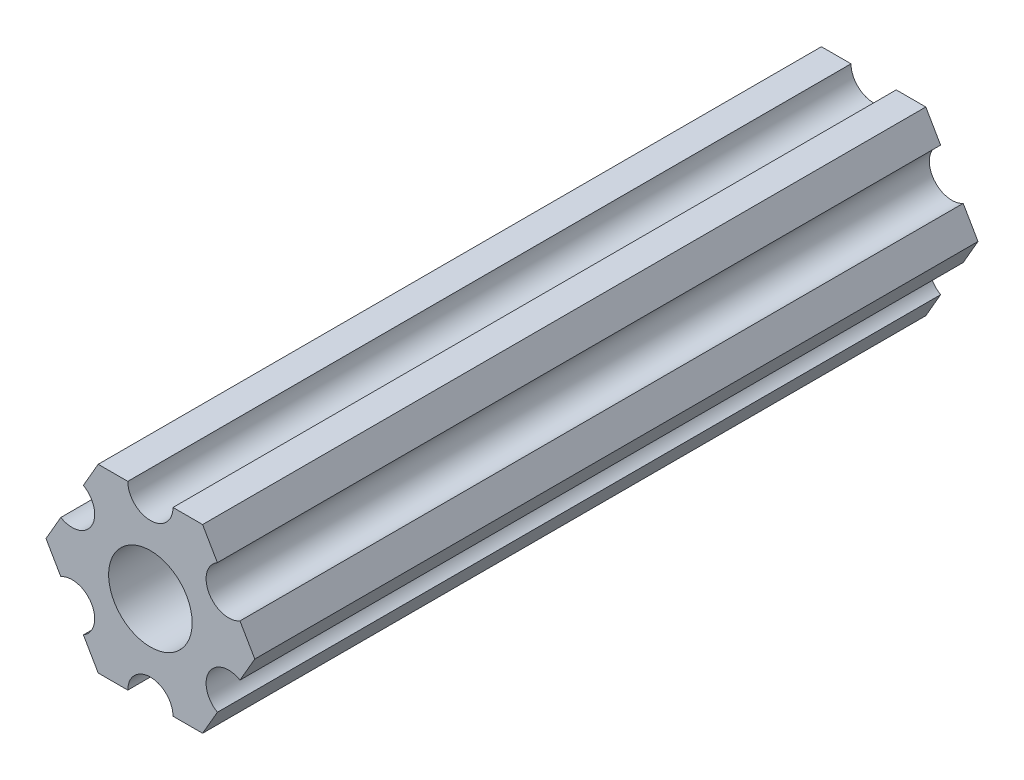
ISO-10303-21;
HEADER;
FILE_DESCRIPTION(('STEP AP214'),'2;1');
FILE_NAME('part.step','',(''),(''),'','','');
FILE_SCHEMA(('AUTOMOTIVE_DESIGN { 1 0 10303 214 1 1 1 1 }'));
ENDSEC;
DATA;
#1=APPLICATION_CONTEXT('core data for automotive mechanical design processes');
#2=APPLICATION_PROTOCOL_DEFINITION('international standard','automotive_design',2000,#1);
#3=PRODUCT_CONTEXT('',#1,'mechanical');
#4=PRODUCT('Part','Part','',(#3));
#5=PRODUCT_RELATED_PRODUCT_CATEGORY('part','',(#4));
#6=PRODUCT_DEFINITION_FORMATION('','',#4);
#7=PRODUCT_DEFINITION_CONTEXT('part definition',#1,'design');
#8=PRODUCT_DEFINITION('design','',#6,#7);
#9=PRODUCT_DEFINITION_SHAPE('','',#8);
#10=(LENGTH_UNIT() NAMED_UNIT(*) SI_UNIT(.MILLI.,.METRE.));
#11=(NAMED_UNIT(*) PLANE_ANGLE_UNIT() SI_UNIT($,.RADIAN.));
#12=(NAMED_UNIT(*) SI_UNIT($,.STERADIAN.) SOLID_ANGLE_UNIT());
#13=UNCERTAINTY_MEASURE_WITH_UNIT(LENGTH_MEASURE(1.E-05),#10,'distance_accuracy_value','');
#14=(GEOMETRIC_REPRESENTATION_CONTEXT(3) GLOBAL_UNCERTAINTY_ASSIGNED_CONTEXT((#13)) GLOBAL_UNIT_ASSIGNED_CONTEXT((#10,
#11,#12)) REPRESENTATION_CONTEXT('',''));
#15=CARTESIAN_POINT('',(0.,0.,0.));
#16=DIRECTION('',(0.,0.,1.));
#17=DIRECTION('',(1.,0.,0.));
#18=AXIS2_PLACEMENT_3D('',#15,#16,#17);
#19=CARTESIAN_POINT('',(5.49926150638083,-3.17499966684068,-50.8));
#20=DIRECTION('',(0.,0.,1.));
#21=DIRECTION('',(1.,0.,0.));
#22=AXIS2_PLACEMENT_3D('',#19,#20,#21);
#23=PLANE('',#22);
#24=CARTESIAN_POINT('',(5.49926150638083,-3.17499966684068,-50.8));
#25=DIRECTION('',(0.,0.,1.));
#26=DIRECTION('',(1.,0.,0.));
#27=AXIS2_PLACEMENT_3D('',#24,#25,#26);
#28=CIRCLE('',#27,1.58750000000001);
#29=CARTESIAN_POINT('',(6.29301142309098,-1.80018429024546,-50.8));
#30=VERTEX_POINT('',#29);
#31=CARTESIAN_POINT('',(4.70551158967068,-4.54981504343589,-50.8));
#32=VERTEX_POINT('',#31);
#33=EDGE_CURVE('E224',#30,#32,#28,.T.);
#34=ORIENTED_EDGE('',*,*,#33,.T.);
#35=DIRECTION('',(-0.499999947533953,-0.866025434075723,0.));
#36=VECTOR('',#35,1.);
#37=CARTESIAN_POINT('',(4.70551158967068,-4.54981504343589,-50.8));
#38=LINE('',#37,#36);
#39=CARTESIAN_POINT('',(3.66617452134693,-6.34999990382519,-50.8));
#40=VERTEX_POINT('',#39);
#41=EDGE_CURVE('E122',#32,#40,#38,.T.);
#42=ORIENTED_EDGE('',*,*,#41,.T.);
#43=DIRECTION('',(-1.,0.,0.));
#44=VECTOR('',#43,1.);
#45=CARTESIAN_POINT('',(3.66617452134693,-6.34999990382519,-50.8));
#46=LINE('',#45,#44);
#47=CARTESIAN_POINT('',(1.58750038469926,-6.34999990382518,-50.8));
#48=VERTEX_POINT('',#47);
#49=EDGE_CURVE('E269',#40,#48,#46,.T.);
#50=ORIENTED_EDGE('',*,*,#49,.T.);
#51=CARTESIAN_POINT('',(3.8469926204343E-07,-6.34999990382519,-50.8));
#52=DIRECTION('',(0.,0.,1.));
#53=DIRECTION('',(1.,0.,0.));
#54=AXIS2_PLACEMENT_3D('',#51,#52,#53);
#55=CIRCLE('',#54,1.5875);
#56=CARTESIAN_POINT('',(-1.58749961530074,-6.34999990382519,-50.8));
#57=VERTEX_POINT('',#56);
#58=EDGE_CURVE('E288',#48,#57,#55,.T.);
#59=ORIENTED_EDGE('',*,*,#58,.T.);
#60=DIRECTION('',(-1.,0.,0.));
#61=VECTOR('',#60,1.);
#62=CARTESIAN_POINT('',(-1.58749961530074,-6.34999990382519,-50.8));
#63=LINE('',#62,#61);
#64=CARTESIAN_POINT('',(-3.66617382465481,-6.34999990382519,-50.8));
#65=VERTEX_POINT('',#64);
#66=EDGE_CURVE('E285',#57,#65,#63,.T.);
#67=ORIENTED_EDGE('',*,*,#66,.T.);
#68=DIRECTION('',(-0.500000006198653,0.866025400205644,0.));
#69=VECTOR('',#68,1.);
#70=CARTESIAN_POINT('',(-3.66617382465481,-6.34999990382519,-50.8));
#71=LINE('',#70,#69);
#72=CARTESIAN_POINT('',(-4.70551094221689,-4.54981523977206,-50.8));
#73=VERTEX_POINT('',#72);
#74=EDGE_CURVE('E287',#65,#73,#71,.T.);
#75=ORIENTED_EDGE('',*,*,#74,.T.);
#76=CARTESIAN_POINT('',(-5.49926095205725,-3.1749999169456,-50.8));
#77=DIRECTION('',(0.,0.,1.));
#78=DIRECTION('',(1.,0.,0.));
#79=AXIS2_PLACEMENT_3D('',#76,#77,#78);
#80=CIRCLE('',#79,1.5875);
#81=CARTESIAN_POINT('',(-6.29301096189761,-1.80018459411914,-50.8));
#82=VERTEX_POINT('',#81);
#83=EDGE_CURVE('E290',#73,#82,#80,.T.);
#84=ORIENTED_EDGE('',*,*,#83,.T.);
#85=DIRECTION('',(-0.500000006198653,0.866025400205645,0.));
#86=VECTOR('',#85,1.);
#87=CARTESIAN_POINT('',(-6.29301096189761,-1.80018459411914,-50.8));
#88=LINE('',#87,#86);
#89=CARTESIAN_POINT('',(-7.33234807945963,6.99338729030344E-08,-50.8));
#90=VERTEX_POINT('',#89);
#91=EDGE_CURVE('E296',#82,#90,#88,.T.);
#92=ORIENTED_EDGE('',*,*,#91,.T.);
#93=DIRECTION('',(0.499999924400249,0.866025447431971,0.));
#94=VECTOR('',#93,1.);
#95=CARTESIAN_POINT('',(-7.33234807945963,6.99338729030344E-08,-50.8));
#96=LINE('',#95,#94);
#97=CARTESIAN_POINT('',(-6.29301121674195,1.80018468525613,-50.8));
#98=VERTEX_POINT('',#97);
#99=EDGE_CURVE('E298',#90,#98,#96,.T.);
#100=ORIENTED_EDGE('',*,*,#99,.T.);
#101=CARTESIAN_POINT('',(-5.49926133675655,3.17500008305439,-50.8));
#102=DIRECTION('',(0.,0.,1.));
#103=DIRECTION('',(1.,0.,0.));
#104=AXIS2_PLACEMENT_3D('',#101,#102,#103);
#105=CIRCLE('',#104,1.5875);
#106=CARTESIAN_POINT('',(-4.70551145677116,4.54981548085265,-50.8));
#107=VERTEX_POINT('',#106);
#108=EDGE_CURVE('E300',#98,#107,#105,.T.);
#109=ORIENTED_EDGE('',*,*,#108,.T.);
#110=DIRECTION('',(0.499999924400249,0.866025447431971,0.));
#111=VECTOR('',#110,1.);
#112=CARTESIAN_POINT('',(-4.70551145677116,4.54981548085265,-50.8));
#113=LINE('',#112,#111);
#114=CARTESIAN_POINT('',(-3.66617452134701,6.35000022210623,-50.8));
#115=VERTEX_POINT('',#114);
#116=EDGE_CURVE('E302',#107,#115,#113,.T.);
#117=ORIENTED_EDGE('',*,*,#116,.T.);
#118=DIRECTION('',(1.,0.,0.));
#119=VECTOR('',#118,1.);
#120=CARTESIAN_POINT('',(-3.66617452134701,6.35000022210623,-50.8));
#121=LINE('',#120,#119);
#122=CARTESIAN_POINT('',(-1.58750038469935,6.35000022210623,-50.8));
#123=VERTEX_POINT('',#122);
#124=EDGE_CURVE('E304',#115,#123,#121,.T.);
#125=ORIENTED_EDGE('',*,*,#124,.T.);
#126=CARTESIAN_POINT('',(-3.84699344941095E-07,6.35000022210623,-50.8));
#127=DIRECTION('',(0.,0.,1.));
#128=DIRECTION('',(1.,0.,0.));
#129=AXIS2_PLACEMENT_3D('',#126,#127,#128);
#130=CIRCLE('',#129,1.5875);
#131=CARTESIAN_POINT('',(1.58749961530066,6.35000022210623,-50.8));
#132=VERTEX_POINT('',#131);
#133=EDGE_CURVE('E306',#123,#132,#130,.T.);
#134=ORIENTED_EDGE('',*,*,#133,.T.);
#135=DIRECTION('',(1.,0.,0.));
#136=VECTOR('',#135,1.);
#137=CARTESIAN_POINT('',(1.58749961530066,6.35000022210623,-50.8));
#138=LINE('',#137,#136);
#139=CARTESIAN_POINT('',(3.66617382465472,6.35000022210622,-50.8));
#140=VERTEX_POINT('',#139);
#141=EDGE_CURVE('E308',#132,#140,#138,.T.);
#142=ORIENTED_EDGE('',*,*,#141,.T.);
#143=DIRECTION('',(0.500000052466056,-0.866025373493145,0.));
#144=VECTOR('',#143,1.);
#145=CARTESIAN_POINT('',(3.66617382465472,6.35000022210622,-50.8));
#146=LINE('',#145,#144);
#147=CARTESIAN_POINT('',(4.70551103839166,4.54981561357968,-50.8));
#148=VERTEX_POINT('',#147);
#149=EDGE_CURVE('E171',#140,#148,#146,.T.);
#150=ORIENTED_EDGE('',*,*,#149,.T.);
#151=CARTESIAN_POINT('',(5.49926112168152,3.17500033315931,-50.8));
#152=DIRECTION('',(0.,0.,1.));
#153=DIRECTION('',(1.,0.,0.));
#154=AXIS2_PLACEMENT_3D('',#151,#152,#153);
#155=CIRCLE('',#154,1.5875);
#156=CARTESIAN_POINT('',(6.29301120497139,1.80018505273895,-50.8));
#157=VERTEX_POINT('',#156);
#158=EDGE_CURVE('E165',#148,#157,#155,.T.);
#159=ORIENTED_EDGE('',*,*,#158,.T.);
#160=DIRECTION('',(0.500000052466056,-0.866025373493145,0.));
#161=VECTOR('',#160,1.);
#162=CARTESIAN_POINT('',(6.29301120497139,1.80018505273895,-50.8));
#163=LINE('',#162,#161);
#164=CARTESIAN_POINT('',(7.33234841870826,4.44212518856872E-07,-50.8));
#165=VERTEX_POINT('',#164);
#166=EDGE_CURVE('E169',#157,#165,#163,.T.);
#167=ORIENTED_EDGE('',*,*,#166,.T.);
#168=DIRECTION('',(-0.499999947533953,-0.866025434075723,0.));
#169=VECTOR('',#168,1.);
#170=CARTESIAN_POINT('',(7.33234841870826,4.44212518856872E-07,-50.8));
#171=LINE('',#170,#169);
#172=EDGE_CURVE('E49',#165,#30,#171,.T.);
#173=ORIENTED_EDGE('',*,*,#172,.T.);
#174=EDGE_LOOP('',(#34,#42,#50,#59,#67,#75,#84,#92,#100,#109,#117,#125,#134,#142,#150,#159,#167,#173));
#175=FACE_BOUND('',#174,.T.);
#176=CARTESIAN_POINT('',(0.,0.,-50.8));
#177=DIRECTION('',(0.,0.,-1.));
#178=DIRECTION('',(1.,0.,0.));
#179=AXIS2_PLACEMENT_3D('',#176,#177,#178);
#180=CIRCLE('',#179,2.9337);
#181=CARTESIAN_POINT('',(2.9337,0.,-50.8));
#182=VERTEX_POINT('',#181);
#183=EDGE_CURVE('E193',#182,#182,#180,.T.);
#184=ORIENTED_EDGE('',*,*,#183,.F.);
#185=EDGE_LOOP('',(#184));
#186=FACE_BOUND('',#185,.T.);
#187=ADVANCED_FACE('F32',(#175,#186),#23,.F.);
#188=CARTESIAN_POINT('',(5.49926150638083,-3.17499966684068,0.));
#189=DIRECTION('',(0.,0.,1.));
#190=DIRECTION('',(1.,0.,0.));
#191=AXIS2_PLACEMENT_3D('',#188,#189,#190);
#192=PLANE('',#191);
#193=CARTESIAN_POINT('',(5.49926150638083,-3.17499966684068,0.));
#194=DIRECTION('',(0.,0.,1.));
#195=DIRECTION('',(1.,0.,0.));
#196=AXIS2_PLACEMENT_3D('',#193,#194,#195);
#197=CIRCLE('',#196,1.58750000000001);
#198=CARTESIAN_POINT('',(6.29301142309098,-1.80018429024546,0.));
#199=VERTEX_POINT('',#198);
#200=CARTESIAN_POINT('',(4.70551158967068,-4.54981504343589,0.));
#201=VERTEX_POINT('',#200);
#202=EDGE_CURVE('E189',#199,#201,#197,.T.);
#203=ORIENTED_EDGE('',*,*,#202,.F.);
#204=DIRECTION('',(-0.499999947533953,-0.866025434075723,0.));
#205=VECTOR('',#204,1.);
#206=CARTESIAN_POINT('',(7.33234841870826,4.44212518856872E-07,0.));
#207=LINE('',#206,#205);
#208=CARTESIAN_POINT('',(7.33234841870826,4.44212518856872E-07,0.));
#209=VERTEX_POINT('',#208);
#210=EDGE_CURVE('E114',#209,#199,#207,.T.);
#211=ORIENTED_EDGE('',*,*,#210,.F.);
#212=DIRECTION('',(0.500000052466056,-0.866025373493145,0.));
#213=VECTOR('',#212,1.);
#214=CARTESIAN_POINT('',(6.29301120497139,1.80018505273895,0.));
#215=LINE('',#214,#213);
#216=CARTESIAN_POINT('',(6.29301120497139,1.80018505273895,0.));
#217=VERTEX_POINT('',#216);
#218=EDGE_CURVE('E108',#217,#209,#215,.T.);
#219=ORIENTED_EDGE('',*,*,#218,.F.);
#220=CARTESIAN_POINT('',(5.49926112168152,3.17500033315931,0.));
#221=DIRECTION('',(0.,0.,1.));
#222=DIRECTION('',(1.,0.,0.));
#223=AXIS2_PLACEMENT_3D('',#220,#221,#222);
#224=CIRCLE('',#223,1.5875);
#225=CARTESIAN_POINT('',(4.70551103839166,4.54981561357968,0.));
#226=VERTEX_POINT('',#225);
#227=EDGE_CURVE('E179',#226,#217,#224,.T.);
#228=ORIENTED_EDGE('',*,*,#227,.F.);
#229=DIRECTION('',(0.500000052466056,-0.866025373493145,0.));
#230=VECTOR('',#229,1.);
#231=CARTESIAN_POINT('',(3.66617382465472,6.35000022210622,0.));
#232=LINE('',#231,#230);
#233=CARTESIAN_POINT('',(3.66617382465472,6.35000022210622,0.));
#234=VERTEX_POINT('',#233);
#235=EDGE_CURVE('E219',#234,#226,#232,.T.);
#236=ORIENTED_EDGE('',*,*,#235,.F.);
#237=DIRECTION('',(1.,0.,0.));
#238=VECTOR('',#237,1.);
#239=CARTESIAN_POINT('',(1.58749961530066,6.35000022210623,0.));
#240=LINE('',#239,#238);
#241=CARTESIAN_POINT('',(1.58749961530066,6.35000022210623,0.));
#242=VERTEX_POINT('',#241);
#243=EDGE_CURVE('E217',#242,#234,#240,.T.);
#244=ORIENTED_EDGE('',*,*,#243,.F.);
#245=CARTESIAN_POINT('',(-3.84699344941095E-07,6.35000022210623,0.));
#246=DIRECTION('',(0.,0.,1.));
#247=DIRECTION('',(1.,0.,0.));
#248=AXIS2_PLACEMENT_3D('',#245,#246,#247);
#249=CIRCLE('',#248,1.5875);
#250=CARTESIAN_POINT('',(-1.58750038469935,6.35000022210623,0.));
#251=VERTEX_POINT('',#250);
#252=EDGE_CURVE('E215',#251,#242,#249,.T.);
#253=ORIENTED_EDGE('',*,*,#252,.F.);
#254=DIRECTION('',(1.,0.,0.));
#255=VECTOR('',#254,1.);
#256=CARTESIAN_POINT('',(-3.66617452134701,6.35000022210623,0.));
#257=LINE('',#256,#255);
#258=CARTESIAN_POINT('',(-3.66617452134701,6.35000022210623,0.));
#259=VERTEX_POINT('',#258);
#260=EDGE_CURVE('E213',#259,#251,#257,.T.);
#261=ORIENTED_EDGE('',*,*,#260,.F.);
#262=DIRECTION('',(0.499999924400249,0.866025447431971,0.));
#263=VECTOR('',#262,1.);
#264=CARTESIAN_POINT('',(-4.70551145677116,4.54981548085265,0.));
#265=LINE('',#264,#263);
#266=CARTESIAN_POINT('',(-4.70551145677116,4.54981548085265,0.));
#267=VERTEX_POINT('',#266);
#268=EDGE_CURVE('E211',#267,#259,#265,.T.);
#269=ORIENTED_EDGE('',*,*,#268,.F.);
#270=CARTESIAN_POINT('',(-5.49926133675655,3.17500008305439,0.));
#271=DIRECTION('',(0.,0.,1.));
#272=DIRECTION('',(1.,0.,0.));
#273=AXIS2_PLACEMENT_3D('',#270,#271,#272);
#274=CIRCLE('',#273,1.5875);
#275=CARTESIAN_POINT('',(-6.29301121674195,1.80018468525613,0.));
#276=VERTEX_POINT('',#275);
#277=EDGE_CURVE('E209',#276,#267,#274,.T.);
#278=ORIENTED_EDGE('',*,*,#277,.F.);
#279=DIRECTION('',(0.499999924400249,0.866025447431971,0.));
#280=VECTOR('',#279,1.);
#281=CARTESIAN_POINT('',(-7.33234807945963,6.99338729030344E-08,0.));
#282=LINE('',#281,#280);
#283=CARTESIAN_POINT('',(-7.33234807945963,6.99338729030344E-08,0.));
#284=VERTEX_POINT('',#283);
#285=EDGE_CURVE('E207',#284,#276,#282,.T.);
#286=ORIENTED_EDGE('',*,*,#285,.F.);
#287=DIRECTION('',(-0.500000006198653,0.866025400205645,0.));
#288=VECTOR('',#287,1.);
#289=CARTESIAN_POINT('',(-6.29301096189761,-1.80018459411914,0.));
#290=LINE('',#289,#288);
#291=CARTESIAN_POINT('',(-6.29301096189761,-1.80018459411914,0.));
#292=VERTEX_POINT('',#291);
#293=EDGE_CURVE('E205',#292,#284,#290,.T.);
#294=ORIENTED_EDGE('',*,*,#293,.F.);
#295=CARTESIAN_POINT('',(-5.49926095205725,-3.1749999169456,0.));
#296=DIRECTION('',(0.,0.,1.));
#297=DIRECTION('',(1.,0.,0.));
#298=AXIS2_PLACEMENT_3D('',#295,#296,#297);
#299=CIRCLE('',#298,1.5875);
#300=CARTESIAN_POINT('',(-4.70551094221689,-4.54981523977206,0.));
#301=VERTEX_POINT('',#300);
#302=EDGE_CURVE('E203',#301,#292,#299,.T.);
#303=ORIENTED_EDGE('',*,*,#302,.F.);
#304=DIRECTION('',(-0.500000006198653,0.866025400205644,0.));
#305=VECTOR('',#304,1.);
#306=CARTESIAN_POINT('',(-3.66617382465481,-6.34999990382519,0.));
#307=LINE('',#306,#305);
#308=CARTESIAN_POINT('',(-3.66617382465481,-6.34999990382519,0.));
#309=VERTEX_POINT('',#308);
#310=EDGE_CURVE('E201',#309,#301,#307,.T.);
#311=ORIENTED_EDGE('',*,*,#310,.F.);
#312=DIRECTION('',(-1.,0.,0.));
#313=VECTOR('',#312,1.);
#314=CARTESIAN_POINT('',(-1.58749961530074,-6.34999990382519,0.));
#315=LINE('',#314,#313);
#316=CARTESIAN_POINT('',(-1.58749961530074,-6.34999990382519,0.));
#317=VERTEX_POINT('',#316);
#318=EDGE_CURVE('E199',#317,#309,#315,.T.);
#319=ORIENTED_EDGE('',*,*,#318,.F.);
#320=CARTESIAN_POINT('',(3.8469926204343E-07,-6.34999990382519,0.));
#321=DIRECTION('',(0.,0.,1.));
#322=DIRECTION('',(1.,0.,0.));
#323=AXIS2_PLACEMENT_3D('',#320,#321,#322);
#324=CIRCLE('',#323,1.5875);
#325=CARTESIAN_POINT('',(1.58750038469926,-6.34999990382518,0.));
#326=VERTEX_POINT('',#325);
#327=EDGE_CURVE('E197',#326,#317,#324,.T.);
#328=ORIENTED_EDGE('',*,*,#327,.F.);
#329=DIRECTION('',(-1.,0.,0.));
#330=VECTOR('',#329,1.);
#331=CARTESIAN_POINT('',(3.66617452134693,-6.34999990382519,0.));
#332=LINE('',#331,#330);
#333=CARTESIAN_POINT('',(3.66617452134693,-6.34999990382519,0.));
#334=VERTEX_POINT('',#333);
#335=EDGE_CURVE('E195',#334,#326,#332,.T.);
#336=ORIENTED_EDGE('',*,*,#335,.F.);
#337=DIRECTION('',(-0.499999947533953,-0.866025434075723,0.));
#338=VECTOR('',#337,1.);
#339=CARTESIAN_POINT('',(4.70551158967068,-4.54981504343589,0.));
#340=LINE('',#339,#338);
#341=EDGE_CURVE('E192',#201,#334,#340,.T.);
#342=ORIENTED_EDGE('',*,*,#341,.F.);
#343=EDGE_LOOP('',(#203,#211,#219,#228,#236,#244,#253,#261,#269,#278,#286,#294,#303,#311,#319,
#328,#336,#342));
#344=FACE_BOUND('',#343,.T.);
#345=CARTESIAN_POINT('',(0.,0.,0.));
#346=DIRECTION('',(0.,0.,-1.));
#347=DIRECTION('',(1.,0.,0.));
#348=AXIS2_PLACEMENT_3D('',#345,#346,#347);
#349=CIRCLE('',#348,2.9337);
#350=CARTESIAN_POINT('',(2.9337,0.,0.));
#351=VERTEX_POINT('',#350);
#352=EDGE_CURVE('E533',#351,#351,#349,.T.);
#353=ORIENTED_EDGE('',*,*,#352,.T.);
#354=EDGE_LOOP('',(#353));
#355=FACE_BOUND('',#354,.T.);
#356=ADVANCED_FACE('F273',(#344,#355),#192,.T.);
#357=CARTESIAN_POINT('',(5.49926150638083,-3.17499966684068,-50.8));
#358=DIRECTION('',(0.,0.,1.));
#359=DIRECTION('',(1.,0.,0.));
#360=AXIS2_PLACEMENT_3D('',#357,#358,#359);
#361=CYLINDRICAL_SURFACE('',#360,1.58750000000001);
#362=ORIENTED_EDGE('',*,*,#202,.T.);
#363=DIRECTION('',(0.,0.,1.));
#364=VECTOR('',#363,1.);
#365=CARTESIAN_POINT('',(4.70551158967068,-4.54981504343589,-50.8));
#366=LINE('',#365,#364);
#367=EDGE_CURVE('E11',#32,#201,#366,.T.);
#368=ORIENTED_EDGE('',*,*,#367,.F.);
#369=ORIENTED_EDGE('',*,*,#33,.F.);
#370=DIRECTION('',(0.,0.,1.));
#371=VECTOR('',#370,1.);
#372=CARTESIAN_POINT('',(6.29301142309098,-1.80018429024546,-50.8));
#373=LINE('',#372,#371);
#374=EDGE_CURVE('E185',#30,#199,#373,.T.);
#375=ORIENTED_EDGE('',*,*,#374,.T.);
#376=EDGE_LOOP('',(#362,#368,#369,#375));
#377=FACE_BOUND('',#376,.T.);
#378=ADVANCED_FACE('F34',(#377),#361,.F.);
#379=CARTESIAN_POINT('',(4.70551158967068,-4.54981504343589,-50.8));
#380=DIRECTION('',(-0.866025434075723,0.499999947533953,0.));
#381=DIRECTION('',(-0.499999947533953,-0.866025434075723,0.));
#382=AXIS2_PLACEMENT_3D('',#379,#380,#381);
#383=PLANE('',#382);
#384=ORIENTED_EDGE('',*,*,#341,.T.);
#385=DIRECTION('',(0.,0.,1.));
#386=VECTOR('',#385,1.);
#387=CARTESIAN_POINT('',(3.66617452134693,-6.34999990382519,-50.8));
#388=LINE('',#387,#386);
#389=EDGE_CURVE('E41',#40,#334,#388,.T.);
#390=ORIENTED_EDGE('',*,*,#389,.F.);
#391=ORIENTED_EDGE('',*,*,#41,.F.);
#392=ORIENTED_EDGE('',*,*,#367,.T.);
#393=EDGE_LOOP('',(#384,#390,#391,#392));
#394=FACE_BOUND('',#393,.T.);
#395=ADVANCED_FACE('F342',(#394),#383,.F.);
#396=CARTESIAN_POINT('',(3.66617452134693,-6.34999990382519,-50.8));
#397=DIRECTION('',(0.,1.,0.));
#398=DIRECTION('',(-1.,0.,0.));
#399=AXIS2_PLACEMENT_3D('',#396,#397,#398);
#400=PLANE('',#399);
#401=ORIENTED_EDGE('',*,*,#335,.T.);
#402=DIRECTION('',(0.,0.,1.));
#403=VECTOR('',#402,1.);
#404=CARTESIAN_POINT('',(1.58750038469926,-6.34999990382518,-50.8));
#405=LINE('',#404,#403);
#406=EDGE_CURVE('E261',#48,#326,#405,.T.);
#407=ORIENTED_EDGE('',*,*,#406,.F.);
#408=ORIENTED_EDGE('',*,*,#49,.F.);
#409=ORIENTED_EDGE('',*,*,#389,.T.);
#410=EDGE_LOOP('',(#401,#407,#408,#409));
#411=FACE_BOUND('',#410,.T.);
#412=ADVANCED_FACE('F267',(#411),#400,.F.);
#413=CARTESIAN_POINT('',(3.8469926204343E-07,-6.34999990382519,-50.8));
#414=DIRECTION('',(0.,0.,1.));
#415=DIRECTION('',(1.,0.,0.));
#416=AXIS2_PLACEMENT_3D('',#413,#414,#415);
#417=CYLINDRICAL_SURFACE('',#416,1.5875);
#418=ORIENTED_EDGE('',*,*,#327,.T.);
#419=DIRECTION('',(0.,0.,1.));
#420=VECTOR('',#419,1.);
#421=CARTESIAN_POINT('',(-1.58749961530074,-6.34999990382519,-50.8));
#422=LINE('',#421,#420);
#423=EDGE_CURVE('E258',#57,#317,#422,.T.);
#424=ORIENTED_EDGE('',*,*,#423,.F.);
#425=ORIENTED_EDGE('',*,*,#58,.F.);
#426=ORIENTED_EDGE('',*,*,#406,.T.);
#427=EDGE_LOOP('',(#418,#424,#425,#426));
#428=FACE_BOUND('',#427,.T.);
#429=ADVANCED_FACE('F279',(#428),#417,.F.);
#430=CARTESIAN_POINT('',(-1.58749961530074,-6.34999990382519,-50.8));
#431=DIRECTION('',(0.,1.,0.));
#432=DIRECTION('',(-1.,0.,0.));
#433=AXIS2_PLACEMENT_3D('',#430,#431,#432);
#434=PLANE('',#433);
#435=ORIENTED_EDGE('',*,*,#318,.T.);
#436=DIRECTION('',(0.,0.,1.));
#437=VECTOR('',#436,1.);
#438=CARTESIAN_POINT('',(-3.66617382465481,-6.34999990382519,-50.8));
#439=LINE('',#438,#437);
#440=EDGE_CURVE('E255',#65,#309,#439,.T.);
#441=ORIENTED_EDGE('',*,*,#440,.F.);
#442=ORIENTED_EDGE('',*,*,#66,.F.);
#443=ORIENTED_EDGE('',*,*,#423,.T.);
#444=EDGE_LOOP('',(#435,#441,#442,#443));
#445=FACE_BOUND('',#444,.T.);
#446=ADVANCED_FACE('F283',(#445),#434,.F.);
#447=CARTESIAN_POINT('',(-3.66617382465481,-6.34999990382519,-50.8));
#448=DIRECTION('',(0.866025400205644,0.500000006198653,0.));
#449=DIRECTION('',(-0.500000006198653,0.866025400205645,0.));
#450=AXIS2_PLACEMENT_3D('',#447,#448,#449);
#451=PLANE('',#450);
#452=ORIENTED_EDGE('',*,*,#310,.T.);
#453=DIRECTION('',(0.,0.,1.));
#454=VECTOR('',#453,1.);
#455=CARTESIAN_POINT('',(-4.70551094221689,-4.54981523977206,-50.8));
#456=LINE('',#455,#454);
#457=EDGE_CURVE('E252',#73,#301,#456,.T.);
#458=ORIENTED_EDGE('',*,*,#457,.F.);
#459=ORIENTED_EDGE('',*,*,#74,.F.);
#460=ORIENTED_EDGE('',*,*,#440,.T.);
#461=EDGE_LOOP('',(#452,#458,#459,#460));
#462=FACE_BOUND('',#461,.T.);
#463=ADVANCED_FACE('F355',(#462),#451,.F.);
#464=CARTESIAN_POINT('',(-5.49926095205725,-3.1749999169456,-50.8));
#465=DIRECTION('',(0.,0.,1.));
#466=DIRECTION('',(1.,0.,0.));
#467=AXIS2_PLACEMENT_3D('',#464,#465,#466);
#468=CYLINDRICAL_SURFACE('',#467,1.5875);
#469=ORIENTED_EDGE('',*,*,#302,.T.);
#470=DIRECTION('',(0.,0.,1.));
#471=VECTOR('',#470,1.);
#472=CARTESIAN_POINT('',(-6.29301096189761,-1.80018459411914,-50.8));
#473=LINE('',#472,#471);
#474=EDGE_CURVE('E249',#82,#292,#473,.T.);
#475=ORIENTED_EDGE('',*,*,#474,.F.);
#476=ORIENTED_EDGE('',*,*,#83,.F.);
#477=ORIENTED_EDGE('',*,*,#457,.T.);
#478=EDGE_LOOP('',(#469,#475,#476,#477));
#479=FACE_BOUND('',#478,.T.);
#480=ADVANCED_FACE('F358',(#479),#468,.F.);
#481=CARTESIAN_POINT('',(-6.29301096189761,-1.80018459411914,-50.8));
#482=DIRECTION('',(0.866025400205645,0.500000006198653,0.));
#483=DIRECTION('',(-0.500000006198653,0.866025400205645,0.));
#484=AXIS2_PLACEMENT_3D('',#481,#482,#483);
#485=PLANE('',#484);
#486=ORIENTED_EDGE('',*,*,#293,.T.);
#487=DIRECTION('',(0.,0.,1.));
#488=VECTOR('',#487,1.);
#489=CARTESIAN_POINT('',(-7.33234807945963,6.99338729030344E-08,-50.8));
#490=LINE('',#489,#488);
#491=EDGE_CURVE('E246',#90,#284,#490,.T.);
#492=ORIENTED_EDGE('',*,*,#491,.F.);
#493=ORIENTED_EDGE('',*,*,#91,.F.);
#494=ORIENTED_EDGE('',*,*,#474,.T.);
#495=EDGE_LOOP('',(#486,#492,#493,#494));
#496=FACE_BOUND('',#495,.T.);
#497=ADVANCED_FACE('F362',(#496),#485,.F.);
#498=CARTESIAN_POINT('',(-7.33234807945963,6.99338729030344E-08,-50.8));
#499=DIRECTION('',(0.866025447431971,-0.499999924400249,0.));
#500=DIRECTION('',(0.499999924400249,0.866025447431971,0.));
#501=AXIS2_PLACEMENT_3D('',#498,#499,#500);
#502=PLANE('',#501);
#503=ORIENTED_EDGE('',*,*,#285,.T.);
#504=DIRECTION('',(0.,0.,1.));
#505=VECTOR('',#504,1.);
#506=CARTESIAN_POINT('',(-6.29301121674195,1.80018468525613,-50.8));
#507=LINE('',#506,#505);
#508=EDGE_CURVE('E243',#98,#276,#507,.T.);
#509=ORIENTED_EDGE('',*,*,#508,.F.);
#510=ORIENTED_EDGE('',*,*,#99,.F.);
#511=ORIENTED_EDGE('',*,*,#491,.T.);
#512=EDGE_LOOP('',(#503,#509,#510,#511));
#513=FACE_BOUND('',#512,.T.);
#514=ADVANCED_FACE('F366',(#513),#502,.F.);
#515=CARTESIAN_POINT('',(-5.49926133675655,3.17500008305439,-50.8));
#516=DIRECTION('',(0.,0.,1.));
#517=DIRECTION('',(1.,0.,0.));
#518=AXIS2_PLACEMENT_3D('',#515,#516,#517);
#519=CYLINDRICAL_SURFACE('',#518,1.5875);
#520=ORIENTED_EDGE('',*,*,#277,.T.);
#521=DIRECTION('',(0.,0.,1.));
#522=VECTOR('',#521,1.);
#523=CARTESIAN_POINT('',(-4.70551145677116,4.54981548085265,-50.8));
#524=LINE('',#523,#522);
#525=EDGE_CURVE('E240',#107,#267,#524,.T.);
#526=ORIENTED_EDGE('',*,*,#525,.F.);
#527=ORIENTED_EDGE('',*,*,#108,.F.);
#528=ORIENTED_EDGE('',*,*,#508,.T.);
#529=EDGE_LOOP('',(#520,#526,#527,#528));
#530=FACE_BOUND('',#529,.T.);
#531=ADVANCED_FACE('F370',(#530),#519,.F.);
#532=CARTESIAN_POINT('',(-4.70551145677116,4.54981548085265,-50.8));
#533=DIRECTION('',(0.866025447431971,-0.499999924400249,0.));
#534=DIRECTION('',(0.499999924400249,0.866025447431971,0.));
#535=AXIS2_PLACEMENT_3D('',#532,#533,#534);
#536=PLANE('',#535);
#537=ORIENTED_EDGE('',*,*,#268,.T.);
#538=DIRECTION('',(0.,0.,1.));
#539=VECTOR('',#538,1.);
#540=CARTESIAN_POINT('',(-3.66617452134701,6.35000022210623,-50.8));
#541=LINE('',#540,#539);
#542=EDGE_CURVE('E237',#115,#259,#541,.T.);
#543=ORIENTED_EDGE('',*,*,#542,.F.);
#544=ORIENTED_EDGE('',*,*,#116,.F.);
#545=ORIENTED_EDGE('',*,*,#525,.T.);
#546=EDGE_LOOP('',(#537,#543,#544,#545));
#547=FACE_BOUND('',#546,.T.);
#548=ADVANCED_FACE('F374',(#547),#536,.F.);
#549=CARTESIAN_POINT('',(-3.66617452134701,6.35000022210623,-50.8));
#550=DIRECTION('',(0.,-1.,0.));
#551=DIRECTION('',(0.,0.,-1.));
#552=AXIS2_PLACEMENT_3D('',#549,#550,#551);
#553=PLANE('',#552);
#554=ORIENTED_EDGE('',*,*,#260,.T.);
#555=DIRECTION('',(0.,0.,1.));
#556=VECTOR('',#555,1.);
#557=CARTESIAN_POINT('',(-1.58750038469935,6.35000022210623,-50.8));
#558=LINE('',#557,#556);
#559=EDGE_CURVE('E234',#123,#251,#558,.T.);
#560=ORIENTED_EDGE('',*,*,#559,.F.);
#561=ORIENTED_EDGE('',*,*,#124,.F.);
#562=ORIENTED_EDGE('',*,*,#542,.T.);
#563=EDGE_LOOP('',(#554,#560,#561,#562));
#564=FACE_BOUND('',#563,.T.);
#565=ADVANCED_FACE('F378',(#564),#553,.F.);
#566=CARTESIAN_POINT('',(-3.84699344941095E-07,6.35000022210623,-50.8));
#567=DIRECTION('',(0.,0.,1.));
#568=DIRECTION('',(1.,0.,0.));
#569=AXIS2_PLACEMENT_3D('',#566,#567,#568);
#570=CYLINDRICAL_SURFACE('',#569,1.5875);
#571=ORIENTED_EDGE('',*,*,#252,.T.);
#572=DIRECTION('',(0.,0.,1.));
#573=VECTOR('',#572,1.);
#574=CARTESIAN_POINT('',(1.58749961530066,6.35000022210623,-50.8));
#575=LINE('',#574,#573);
#576=EDGE_CURVE('E231',#132,#242,#575,.T.);
#577=ORIENTED_EDGE('',*,*,#576,.F.);
#578=ORIENTED_EDGE('',*,*,#133,.F.);
#579=ORIENTED_EDGE('',*,*,#559,.T.);
#580=EDGE_LOOP('',(#571,#577,#578,#579));
#581=FACE_BOUND('',#580,.T.);
#582=ADVANCED_FACE('F382',(#581),#570,.F.);
#583=CARTESIAN_POINT('',(1.58749961530066,6.35000022210623,-50.8));
#584=DIRECTION('',(0.,-1.,0.));
#585=DIRECTION('',(1.,0.,0.));
#586=AXIS2_PLACEMENT_3D('',#583,#584,#585);
#587=PLANE('',#586);
#588=ORIENTED_EDGE('',*,*,#243,.T.);
#589=DIRECTION('',(0.,0.,1.));
#590=VECTOR('',#589,1.);
#591=CARTESIAN_POINT('',(3.66617382465472,6.35000022210622,-50.8));
#592=LINE('',#591,#590);
#593=EDGE_CURVE('E228',#140,#234,#592,.T.);
#594=ORIENTED_EDGE('',*,*,#593,.F.);
#595=ORIENTED_EDGE('',*,*,#141,.F.);
#596=ORIENTED_EDGE('',*,*,#576,.T.);
#597=EDGE_LOOP('',(#588,#594,#595,#596));
#598=FACE_BOUND('',#597,.T.);
#599=ADVANCED_FACE('F314',(#598),#587,.F.);
#600=CARTESIAN_POINT('',(3.66617382465472,6.35000022210622,-50.8));
#601=DIRECTION('',(-0.866025373493145,-0.500000052466056,0.));
#602=DIRECTION('',(0.500000052466056,-0.866025373493145,0.));
#603=AXIS2_PLACEMENT_3D('',#600,#601,#602);
#604=PLANE('',#603);
#605=ORIENTED_EDGE('',*,*,#235,.T.);
#606=DIRECTION('',(0.,0.,1.));
#607=VECTOR('',#606,1.);
#608=CARTESIAN_POINT('',(4.70551103839166,4.54981561357968,-50.8));
#609=LINE('',#608,#607);
#610=EDGE_CURVE('E180',#148,#226,#609,.T.);
#611=ORIENTED_EDGE('',*,*,#610,.F.);
#612=ORIENTED_EDGE('',*,*,#149,.F.);
#613=ORIENTED_EDGE('',*,*,#593,.T.);
#614=EDGE_LOOP('',(#605,#611,#612,#613));
#615=FACE_BOUND('',#614,.T.);
#616=ADVANCED_FACE('F318',(#615),#604,.F.);
#617=CARTESIAN_POINT('',(5.49926112168152,3.17500033315931,-50.8));
#618=DIRECTION('',(0.,0.,1.));
#619=DIRECTION('',(1.,0.,0.));
#620=AXIS2_PLACEMENT_3D('',#617,#618,#619);
#621=CYLINDRICAL_SURFACE('',#620,1.5875);
#622=ORIENTED_EDGE('',*,*,#227,.T.);
#623=DIRECTION('',(0.,0.,1.));
#624=VECTOR('',#623,1.);
#625=CARTESIAN_POINT('',(6.29301120497139,1.80018505273895,-50.8));
#626=LINE('',#625,#624);
#627=EDGE_CURVE('E176',#157,#217,#626,.T.);
#628=ORIENTED_EDGE('',*,*,#627,.F.);
#629=ORIENTED_EDGE('',*,*,#158,.F.);
#630=ORIENTED_EDGE('',*,*,#610,.T.);
#631=EDGE_LOOP('',(#622,#628,#629,#630));
#632=FACE_BOUND('',#631,.T.);
#633=ADVANCED_FACE('F177',(#632),#621,.F.);
#634=CARTESIAN_POINT('',(6.29301120497139,1.80018505273895,-50.8));
#635=DIRECTION('',(-0.866025373493145,-0.500000052466056,0.));
#636=DIRECTION('',(0.500000052466056,-0.866025373493145,0.));
#637=AXIS2_PLACEMENT_3D('',#634,#635,#636);
#638=PLANE('',#637);
#639=ORIENTED_EDGE('',*,*,#218,.T.);
#640=DIRECTION('',(0.,0.,1.));
#641=VECTOR('',#640,1.);
#642=CARTESIAN_POINT('',(7.33234841870826,4.44212518856872E-07,-50.8));
#643=LINE('',#642,#641);
#644=EDGE_CURVE('E181',#165,#209,#643,.T.);
#645=ORIENTED_EDGE('',*,*,#644,.F.);
#646=ORIENTED_EDGE('',*,*,#166,.F.);
#647=ORIENTED_EDGE('',*,*,#627,.T.);
#648=EDGE_LOOP('',(#639,#645,#646,#647));
#649=FACE_BOUND('',#648,.T.);
#650=ADVANCED_FACE('F183',(#649),#638,.F.);
#651=CARTESIAN_POINT('',(7.33234841870826,4.44212518856872E-07,-50.8));
#652=DIRECTION('',(-0.866025434075723,0.499999947533953,0.));
#653=DIRECTION('',(-0.499999947533953,-0.866025434075723,0.));
#654=AXIS2_PLACEMENT_3D('',#651,#652,#653);
#655=PLANE('',#654);
#656=ORIENTED_EDGE('',*,*,#210,.T.);
#657=ORIENTED_EDGE('',*,*,#374,.F.);
#658=ORIENTED_EDGE('',*,*,#172,.F.);
#659=ORIENTED_EDGE('',*,*,#644,.T.);
#660=EDGE_LOOP('',(#656,#657,#658,#659));
#661=FACE_BOUND('',#660,.T.);
#662=ADVANCED_FACE('F322',(#661),#655,.F.);
#663=CARTESIAN_POINT('',(0.,0.,-50.8));
#664=DIRECTION('',(0.,0.,1.));
#665=DIRECTION('',(1.,0.,0.));
#666=AXIS2_PLACEMENT_3D('',#663,#664,#665);
#667=CYLINDRICAL_SURFACE('',#666,2.9337);
#668=ORIENTED_EDGE('',*,*,#183,.T.);
#669=EDGE_LOOP('',(#668));
#670=FACE_BOUND('',#669,.T.);
#671=ORIENTED_EDGE('',*,*,#352,.F.);
#672=EDGE_LOOP('',(#671));
#673=FACE_BOUND('',#672,.T.);
#674=ADVANCED_FACE('F324',(#670,#673),#667,.F.);
#675=CLOSED_SHELL('',(#187,#356,#378,#395,#412,#429,#446,#463,#480,#497,#514,#531,#548,#565,
#582,#599,#616,#633,#650,#662,#674));
#676=MANIFOLD_SOLID_BREP('B2',#675);
#677=ADVANCED_BREP_SHAPE_REPRESENTATION('',(#18,#676),#14);
#678=SHAPE_DEFINITION_REPRESENTATION(#9,#677);
ENDSEC;
END-ISO-10303-21;
